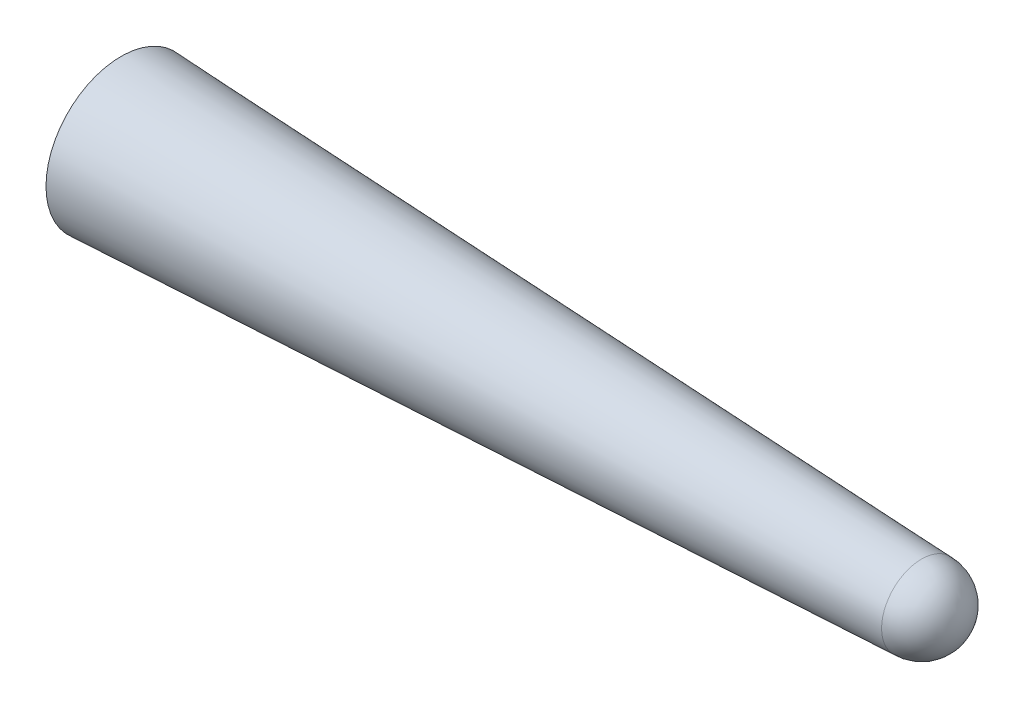
ISO-10303-21;
HEADER;
FILE_DESCRIPTION(('STEP AP214'),'2;1');
FILE_NAME('part.step','',(''),(''),'','','');
FILE_SCHEMA(('AUTOMOTIVE_DESIGN { 1 0 10303 214 1 1 1 1 }'));
ENDSEC;
DATA;
#1=APPLICATION_CONTEXT('core data for automotive mechanical design processes');
#2=APPLICATION_PROTOCOL_DEFINITION('international standard','automotive_design',2000,#1);
#3=PRODUCT_CONTEXT('',#1,'mechanical');
#4=PRODUCT('Part','Part','',(#3));
#5=PRODUCT_RELATED_PRODUCT_CATEGORY('part','',(#4));
#6=PRODUCT_DEFINITION_FORMATION('','',#4);
#7=PRODUCT_DEFINITION_CONTEXT('part definition',#1,'design');
#8=PRODUCT_DEFINITION('design','',#6,#7);
#9=PRODUCT_DEFINITION_SHAPE('','',#8);
#10=(LENGTH_UNIT() NAMED_UNIT(*) SI_UNIT(.MILLI.,.METRE.));
#11=(NAMED_UNIT(*) PLANE_ANGLE_UNIT() SI_UNIT($,.RADIAN.));
#12=(NAMED_UNIT(*) SI_UNIT($,.STERADIAN.) SOLID_ANGLE_UNIT());
#13=UNCERTAINTY_MEASURE_WITH_UNIT(LENGTH_MEASURE(1.E-05),#10,'distance_accuracy_value','');
#14=(GEOMETRIC_REPRESENTATION_CONTEXT(3) GLOBAL_UNCERTAINTY_ASSIGNED_CONTEXT((#13)) GLOBAL_UNIT_ASSIGNED_CONTEXT((#10,
#11,#12)) REPRESENTATION_CONTEXT('',''));
#15=CARTESIAN_POINT('',(0.,0.,0.));
#16=DIRECTION('',(0.,0.,1.));
#17=DIRECTION('',(1.,0.,0.));
#18=AXIS2_PLACEMENT_3D('',#15,#16,#17);
#19=CARTESIAN_POINT('',(-105.609644072977,-24.1918444086502,0.));
#20=DIRECTION('',(1.,0.,0.));
#21=DIRECTION('',(0.,0.,-1.));
#22=AXIS2_PLACEMENT_3D('',#19,#20,#21);
#23=PLANE('',#22);
#24=CARTESIAN_POINT('',(-105.609644072977,-24.1918444086502,0.));
#25=DIRECTION('',(-1.,0.,0.));
#26=DIRECTION('',(0.,0.,1.));
#27=AXIS2_PLACEMENT_3D('',#24,#25,#26);
#28=CIRCLE('',#27,7.5);
#29=CARTESIAN_POINT('',(-105.609644072977,-24.1918444086502,7.5));
#30=VERTEX_POINT('',#29);
#31=EDGE_CURVE('E10',#30,#30,#28,.T.);
#32=ORIENTED_EDGE('',*,*,#31,.T.);
#33=EDGE_LOOP('',(#32));
#34=FACE_BOUND('',#33,.T.);
#35=ADVANCED_FACE('F39',(#34),#23,.F.);
#36=CARTESIAN_POINT('',(-25.6096440729774,-24.1918444086502,0.));
#37=DIRECTION('',(-1.,0.,0.));
#38=DIRECTION('',(0.,0.,1.));
#39=AXIS2_PLACEMENT_3D('',#36,#37,#38);
#40=CONICAL_SURFACE('',#39,4.,0.0437221186015876);
#41=ORIENTED_EDGE('',*,*,#31,.F.);
#42=EDGE_LOOP('',(#41));
#43=FACE_BOUND('',#42,.T.);
#44=CARTESIAN_POINT('',(-25.6096440729774,-24.1918444086502,0.));
#45=DIRECTION('',(-1.,0.,0.));
#46=DIRECTION('',(0.,0.,1.));
#47=AXIS2_PLACEMENT_3D('',#44,#45,#46);
#48=CIRCLE('',#47,4.);
#49=CARTESIAN_POINT('',(-25.6096440729774,-24.1918444086502,4.));
#50=VERTEX_POINT('',#49);
#51=EDGE_CURVE('E46',#50,#50,#48,.T.);
#52=ORIENTED_EDGE('',*,*,#51,.T.);
#53=EDGE_LOOP('',(#52));
#54=FACE_BOUND('',#53,.T.);
#55=ADVANCED_FACE('F53',(#43,#54),#40,.T.);
#56=CARTESIAN_POINT('',(-25.6096440729774,-24.1918444086502,0.));
#57=DIRECTION('',(-1.,0.,0.));
#58=DIRECTION('',(0.,1.,0.));
#59=AXIS2_PLACEMENT_3D('',#56,#57,#58);
#60=SPHERICAL_SURFACE('',#59,4.);
#61=ORIENTED_EDGE('',*,*,#51,.F.);
#62=EDGE_LOOP('',(#61));
#63=FACE_BOUND('',#62,.T.);
#64=ADVANCED_FACE('F55',(#63),#60,.T.);
#65=CLOSED_SHELL('',(#35,#55,#64));
#66=MANIFOLD_SOLID_BREP('B2',#65);
#67=ADVANCED_BREP_SHAPE_REPRESENTATION('',(#18,#66),#14);
#68=SHAPE_DEFINITION_REPRESENTATION(#9,#67);
ENDSEC;
END-ISO-10303-21;
